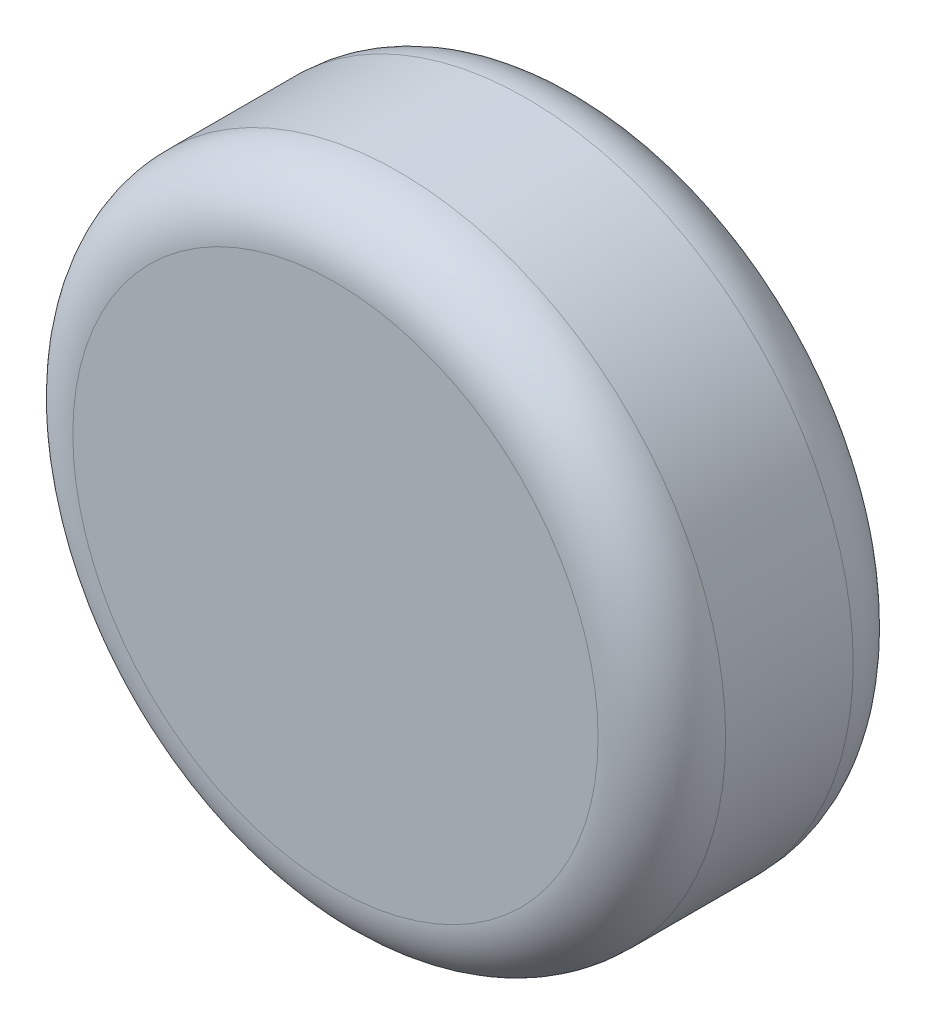
ISO-10303-21;
HEADER;
FILE_DESCRIPTION(('STEP AP214'),'2;1');
FILE_NAME('part.step','',(''),(''),'','','');
FILE_SCHEMA(('AUTOMOTIVE_DESIGN { 1 0 10303 214 1 1 1 1 }'));
ENDSEC;
DATA;
#1=APPLICATION_CONTEXT('core data for automotive mechanical design processes');
#2=APPLICATION_PROTOCOL_DEFINITION('international standard','automotive_design',2000,#1);
#3=PRODUCT_CONTEXT('',#1,'mechanical');
#4=PRODUCT('Part','Part','',(#3));
#5=PRODUCT_RELATED_PRODUCT_CATEGORY('part','',(#4));
#6=PRODUCT_DEFINITION_FORMATION('','',#4);
#7=PRODUCT_DEFINITION_CONTEXT('part definition',#1,'design');
#8=PRODUCT_DEFINITION('design','',#6,#7);
#9=PRODUCT_DEFINITION_SHAPE('','',#8);
#10=(LENGTH_UNIT() NAMED_UNIT(*) SI_UNIT(.MILLI.,.METRE.));
#11=(NAMED_UNIT(*) PLANE_ANGLE_UNIT() SI_UNIT($,.RADIAN.));
#12=(NAMED_UNIT(*) SI_UNIT($,.STERADIAN.) SOLID_ANGLE_UNIT());
#13=UNCERTAINTY_MEASURE_WITH_UNIT(LENGTH_MEASURE(1.E-05),#10,'distance_accuracy_value','');
#14=(GEOMETRIC_REPRESENTATION_CONTEXT(3) GLOBAL_UNCERTAINTY_ASSIGNED_CONTEXT((#13)) GLOBAL_UNIT_ASSIGNED_CONTEXT((#10,
#11,#12)) REPRESENTATION_CONTEXT('',''));
#15=CARTESIAN_POINT('',(0.,0.,0.));
#16=DIRECTION('',(0.,0.,1.));
#17=DIRECTION('',(1.,0.,0.));
#18=AXIS2_PLACEMENT_3D('',#15,#16,#17);
#19=CARTESIAN_POINT('',(0.,0.,25.4));
#20=DIRECTION('',(0.,0.,-1.));
#21=DIRECTION('',(-1.,0.,0.));
#22=AXIS2_PLACEMENT_3D('',#19,#20,#21);
#23=CYLINDRICAL_SURFACE('',#22,32.5);
#24=CARTESIAN_POINT('',(0.,0.,6.35));
#25=DIRECTION('',(0.,0.,1.));
#26=DIRECTION('',(1.,0.,0.));
#27=AXIS2_PLACEMENT_3D('',#24,#25,#26);
#28=CIRCLE('',#27,32.5);
#29=CARTESIAN_POINT('',(32.5,0.,6.35));
#30=VERTEX_POINT('',#29);
#31=EDGE_CURVE('E148',#30,#30,#28,.T.);
#32=ORIENTED_EDGE('',*,*,#31,.T.);
#33=EDGE_LOOP('',(#32));
#34=FACE_BOUND('',#33,.T.);
#35=CARTESIAN_POINT('',(0.,0.,19.05));
#36=DIRECTION('',(0.,0.,1.));
#37=DIRECTION('',(1.,0.,0.));
#38=AXIS2_PLACEMENT_3D('',#35,#36,#37);
#39=CIRCLE('',#38,32.5);
#40=CARTESIAN_POINT('',(32.5,0.,19.05));
#41=VERTEX_POINT('',#40);
#42=EDGE_CURVE('E140',#41,#41,#39,.F.);
#43=ORIENTED_EDGE('',*,*,#42,.T.);
#44=EDGE_LOOP('',(#43));
#45=FACE_BOUND('',#44,.T.);
#46=ADVANCED_FACE('F38',(#34,#45),#23,.T.);
#47=CARTESIAN_POINT('',(0.,0.,25.4));
#48=DIRECTION('',(0.,0.,1.));
#49=DIRECTION('',(1.,0.,0.));
#50=AXIS2_PLACEMENT_3D('',#47,#48,#49);
#51=PLANE('',#50);
#52=CARTESIAN_POINT('',(0.,0.,25.4));
#53=DIRECTION('',(0.,0.,1.));
#54=DIRECTION('',(1.,0.,0.));
#55=AXIS2_PLACEMENT_3D('',#52,#53,#54);
#56=CIRCLE('',#55,26.15);
#57=CARTESIAN_POINT('',(26.15,0.,25.4));
#58=VERTEX_POINT('',#57);
#59=EDGE_CURVE('E11',#58,#58,#56,.T.);
#60=ORIENTED_EDGE('',*,*,#59,.T.);
#61=EDGE_LOOP('',(#60));
#62=FACE_BOUND('',#61,.T.);
#63=ADVANCED_FACE('F162',(#62),#51,.T.);
#64=CARTESIAN_POINT('',(0.,0.,0.));
#65=DIRECTION('',(0.,0.,1.));
#66=DIRECTION('',(1.,0.,0.));
#67=AXIS2_PLACEMENT_3D('',#64,#65,#66);
#68=PLANE('',#67);
#69=DIRECTION('',(-0.5,0.866025403784439,0.));
#70=VECTOR('',#69,1.);
#71=CARTESIAN_POINT('',(-3.46410161513776,-6.,0.));
#72=LINE('',#71,#70);
#73=CARTESIAN_POINT('',(-3.46410161513776,-6.,0.));
#74=VERTEX_POINT('',#73);
#75=CARTESIAN_POINT('',(-6.92820323027551,0.,0.));
#76=VERTEX_POINT('',#75);
#77=EDGE_CURVE('E127',#74,#76,#72,.T.);
#78=ORIENTED_EDGE('',*,*,#77,.F.);
#79=DIRECTION('',(-1.,0.,0.));
#80=VECTOR('',#79,1.);
#81=CARTESIAN_POINT('',(3.46410161513776,-6.,0.));
#82=LINE('',#81,#80);
#83=CARTESIAN_POINT('',(3.46410161513776,-6.,0.));
#84=VERTEX_POINT('',#83);
#85=EDGE_CURVE('E53',#84,#74,#82,.T.);
#86=ORIENTED_EDGE('',*,*,#85,.F.);
#87=DIRECTION('',(-0.5,-0.866025403784439,0.));
#88=VECTOR('',#87,1.);
#89=CARTESIAN_POINT('',(6.92820323027551,0.,0.));
#90=LINE('',#89,#88);
#91=CARTESIAN_POINT('',(6.92820323027551,0.,0.));
#92=VERTEX_POINT('',#91);
#93=EDGE_CURVE('E136',#92,#84,#90,.T.);
#94=ORIENTED_EDGE('',*,*,#93,.F.);
#95=DIRECTION('',(0.5,-0.866025403784439,0.));
#96=VECTOR('',#95,1.);
#97=CARTESIAN_POINT('',(3.46410161513776,6.,0.));
#98=LINE('',#97,#96);
#99=CARTESIAN_POINT('',(3.46410161513776,6.,0.));
#100=VERTEX_POINT('',#99);
#101=EDGE_CURVE('E134',#100,#92,#98,.T.);
#102=ORIENTED_EDGE('',*,*,#101,.F.);
#103=DIRECTION('',(1.,0.,0.));
#104=VECTOR('',#103,1.);
#105=CARTESIAN_POINT('',(-3.46410161513776,6.,0.));
#106=LINE('',#105,#104);
#107=CARTESIAN_POINT('',(-3.46410161513776,6.,0.));
#108=VERTEX_POINT('',#107);
#109=EDGE_CURVE('E101',#108,#100,#106,.T.);
#110=ORIENTED_EDGE('',*,*,#109,.F.);
#111=DIRECTION('',(0.5,0.866025403784439,0.));
#112=VECTOR('',#111,1.);
#113=CARTESIAN_POINT('',(-6.92820323027551,0.,0.));
#114=LINE('',#113,#112);
#115=EDGE_CURVE('E130',#76,#108,#114,.T.);
#116=ORIENTED_EDGE('',*,*,#115,.F.);
#117=EDGE_LOOP('',(#78,#86,#94,#102,#110,#116));
#118=FACE_BOUND('',#117,.T.);
#119=CARTESIAN_POINT('',(0.,0.,0.));
#120=DIRECTION('',(0.,0.,1.));
#121=DIRECTION('',(1.,0.,0.));
#122=AXIS2_PLACEMENT_3D('',#119,#120,#121);
#123=CIRCLE('',#122,26.15);
#124=CARTESIAN_POINT('',(26.15,0.,0.));
#125=VERTEX_POINT('',#124);
#126=EDGE_CURVE('E46',#125,#125,#123,.F.);
#127=ORIENTED_EDGE('',*,*,#126,.T.);
#128=EDGE_LOOP('',(#127));
#129=FACE_BOUND('',#128,.T.);
#130=ADVANCED_FACE('F153',(#118,#129),#68,.F.);
#131=CARTESIAN_POINT('',(0.,0.,6.35));
#132=DIRECTION('',(0.,0.,1.));
#133=DIRECTION('',(1.,0.,0.));
#134=AXIS2_PLACEMENT_3D('',#131,#132,#133);
#135=TOROIDAL_SURFACE('',#134,26.15,6.35);
#136=ORIENTED_EDGE('',*,*,#126,.F.);
#137=EDGE_LOOP('',(#136));
#138=FACE_BOUND('',#137,.T.);
#139=ORIENTED_EDGE('',*,*,#31,.F.);
#140=EDGE_LOOP('',(#139));
#141=FACE_BOUND('',#140,.T.);
#142=ADVANCED_FACE('F155',(#138,#141),#135,.T.);
#143=CARTESIAN_POINT('',(0.,0.,19.05));
#144=DIRECTION('',(0.,0.,1.));
#145=DIRECTION('',(1.,0.,0.));
#146=AXIS2_PLACEMENT_3D('',#143,#144,#145);
#147=TOROIDAL_SURFACE('',#146,26.15,6.35);
#148=ORIENTED_EDGE('',*,*,#42,.F.);
#149=EDGE_LOOP('',(#148));
#150=FACE_BOUND('',#149,.T.);
#151=ORIENTED_EDGE('',*,*,#59,.F.);
#152=EDGE_LOOP('',(#151));
#153=FACE_BOUND('',#152,.T.);
#154=ADVANCED_FACE('F40',(#150,#153),#147,.T.);
#155=CARTESIAN_POINT('',(3.46410161513776,-6.,15.621));
#156=DIRECTION('',(0.,-1.,0.));
#157=DIRECTION('',(0.,0.,-1.));
#158=AXIS2_PLACEMENT_3D('',#155,#156,#157);
#159=PLANE('',#158);
#160=ORIENTED_EDGE('',*,*,#85,.T.);
#161=DIRECTION('',(0.,0.,-1.));
#162=VECTOR('',#161,1.);
#163=CARTESIAN_POINT('',(-3.46410161513776,-6.,15.621));
#164=LINE('',#163,#162);
#165=CARTESIAN_POINT('',(-3.46410161513776,-6.,15.621));
#166=VERTEX_POINT('',#165);
#167=EDGE_CURVE('E83',#166,#74,#164,.T.);
#168=ORIENTED_EDGE('',*,*,#167,.F.);
#169=DIRECTION('',(-1.,0.,0.));
#170=VECTOR('',#169,1.);
#171=CARTESIAN_POINT('',(3.46410161513776,-6.,15.621));
#172=LINE('',#171,#170);
#173=CARTESIAN_POINT('',(3.46410161513776,-6.,15.621));
#174=VERTEX_POINT('',#173);
#175=EDGE_CURVE('E138',#174,#166,#172,.T.);
#176=ORIENTED_EDGE('',*,*,#175,.F.);
#177=DIRECTION('',(0.,0.,-1.));
#178=VECTOR('',#177,1.);
#179=CARTESIAN_POINT('',(3.46410161513776,-6.,15.621));
#180=LINE('',#179,#178);
#181=EDGE_CURVE('E61',#174,#84,#180,.T.);
#182=ORIENTED_EDGE('',*,*,#181,.T.);
#183=EDGE_LOOP('',(#160,#168,#176,#182));
#184=FACE_BOUND('',#183,.T.);
#185=ADVANCED_FACE('F168',(#184),#159,.F.);
#186=CARTESIAN_POINT('',(6.92820323027551,0.,15.621));
#187=DIRECTION('',(0.866025403784439,-0.5,0.));
#188=DIRECTION('',(0.5,0.866025403784439,0.));
#189=AXIS2_PLACEMENT_3D('',#186,#187,#188);
#190=PLANE('',#189);
#191=ORIENTED_EDGE('',*,*,#93,.T.);
#192=ORIENTED_EDGE('',*,*,#181,.F.);
#193=DIRECTION('',(-0.5,-0.866025403784439,0.));
#194=VECTOR('',#193,1.);
#195=CARTESIAN_POINT('',(6.92820323027551,0.,15.621));
#196=LINE('',#195,#194);
#197=CARTESIAN_POINT('',(6.92820323027551,0.,15.621));
#198=VERTEX_POINT('',#197);
#199=EDGE_CURVE('E113',#198,#174,#196,.T.);
#200=ORIENTED_EDGE('',*,*,#199,.F.);
#201=DIRECTION('',(0.,0.,-1.));
#202=VECTOR('',#201,1.);
#203=CARTESIAN_POINT('',(6.92820323027551,0.,15.621));
#204=LINE('',#203,#202);
#205=EDGE_CURVE('E105',#198,#92,#204,.T.);
#206=ORIENTED_EDGE('',*,*,#205,.T.);
#207=EDGE_LOOP('',(#191,#192,#200,#206));
#208=FACE_BOUND('',#207,.T.);
#209=ADVANCED_FACE('F181',(#208),#190,.F.);
#210=CARTESIAN_POINT('',(3.46410161513776,6.,15.621));
#211=DIRECTION('',(0.866025403784439,0.5,0.));
#212=DIRECTION('',(-0.5,0.866025403784439,0.));
#213=AXIS2_PLACEMENT_3D('',#210,#211,#212);
#214=PLANE('',#213);
#215=ORIENTED_EDGE('',*,*,#101,.T.);
#216=ORIENTED_EDGE('',*,*,#205,.F.);
#217=DIRECTION('',(0.5,-0.866025403784439,0.));
#218=VECTOR('',#217,1.);
#219=CARTESIAN_POINT('',(3.46410161513776,6.,15.621));
#220=LINE('',#219,#218);
#221=CARTESIAN_POINT('',(3.46410161513776,6.,15.621));
#222=VERTEX_POINT('',#221);
#223=EDGE_CURVE('E109',#222,#198,#220,.T.);
#224=ORIENTED_EDGE('',*,*,#223,.F.);
#225=DIRECTION('',(0.,0.,-1.));
#226=VECTOR('',#225,1.);
#227=CARTESIAN_POINT('',(3.46410161513776,6.,15.621));
#228=LINE('',#227,#226);
#229=EDGE_CURVE('E94',#222,#100,#228,.T.);
#230=ORIENTED_EDGE('',*,*,#229,.T.);
#231=EDGE_LOOP('',(#215,#216,#224,#230));
#232=FACE_BOUND('',#231,.T.);
#233=ADVANCED_FACE('F110',(#232),#214,.F.);
#234=CARTESIAN_POINT('',(-3.46410161513776,6.,15.621));
#235=DIRECTION('',(0.,1.,0.));
#236=DIRECTION('',(0.,0.,1.));
#237=AXIS2_PLACEMENT_3D('',#234,#235,#236);
#238=PLANE('',#237);
#239=ORIENTED_EDGE('',*,*,#109,.T.);
#240=ORIENTED_EDGE('',*,*,#229,.F.);
#241=DIRECTION('',(1.,0.,0.));
#242=VECTOR('',#241,1.);
#243=CARTESIAN_POINT('',(-3.46410161513776,6.,15.621));
#244=LINE('',#243,#242);
#245=CARTESIAN_POINT('',(-3.46410161513776,6.,15.621));
#246=VERTEX_POINT('',#245);
#247=EDGE_CURVE('E98',#246,#222,#244,.T.);
#248=ORIENTED_EDGE('',*,*,#247,.F.);
#249=DIRECTION('',(0.,0.,-1.));
#250=VECTOR('',#249,1.);
#251=CARTESIAN_POINT('',(-3.46410161513776,6.,15.621));
#252=LINE('',#251,#250);
#253=EDGE_CURVE('E106',#246,#108,#252,.T.);
#254=ORIENTED_EDGE('',*,*,#253,.T.);
#255=EDGE_LOOP('',(#239,#240,#248,#254));
#256=FACE_BOUND('',#255,.T.);
#257=ADVANCED_FACE('F96',(#256),#238,.F.);
#258=CARTESIAN_POINT('',(-6.92820323027551,0.,15.621));
#259=DIRECTION('',(-0.866025403784439,0.5,0.));
#260=DIRECTION('',(-0.5,-0.866025403784439,0.));
#261=AXIS2_PLACEMENT_3D('',#258,#259,#260);
#262=PLANE('',#261);
#263=ORIENTED_EDGE('',*,*,#115,.T.);
#264=ORIENTED_EDGE('',*,*,#253,.F.);
#265=DIRECTION('',(0.5,0.866025403784439,0.));
#266=VECTOR('',#265,1.);
#267=CARTESIAN_POINT('',(-6.92820323027551,0.,15.621));
#268=LINE('',#267,#266);
#269=CARTESIAN_POINT('',(-6.92820323027551,0.,15.621));
#270=VERTEX_POINT('',#269);
#271=EDGE_CURVE('E119',#270,#246,#268,.T.);
#272=ORIENTED_EDGE('',*,*,#271,.F.);
#273=DIRECTION('',(0.,0.,-1.));
#274=VECTOR('',#273,1.);
#275=CARTESIAN_POINT('',(-6.92820323027551,0.,15.621));
#276=LINE('',#275,#274);
#277=EDGE_CURVE('E143',#270,#76,#276,.T.);
#278=ORIENTED_EDGE('',*,*,#277,.T.);
#279=EDGE_LOOP('',(#263,#264,#272,#278));
#280=FACE_BOUND('',#279,.T.);
#281=ADVANCED_FACE('F185',(#280),#262,.F.);
#282=CARTESIAN_POINT('',(-3.46410161513776,-6.,15.621));
#283=DIRECTION('',(-0.866025403784438,-0.5,0.));
#284=DIRECTION('',(0.5,-0.866025403784439,0.));
#285=AXIS2_PLACEMENT_3D('',#282,#283,#284);
#286=PLANE('',#285);
#287=ORIENTED_EDGE('',*,*,#77,.T.);
#288=ORIENTED_EDGE('',*,*,#277,.F.);
#289=DIRECTION('',(-0.5,0.866025403784439,0.));
#290=VECTOR('',#289,1.);
#291=CARTESIAN_POINT('',(-3.46410161513776,-6.,15.621));
#292=LINE('',#291,#290);
#293=EDGE_CURVE('E121',#166,#270,#292,.T.);
#294=ORIENTED_EDGE('',*,*,#293,.F.);
#295=ORIENTED_EDGE('',*,*,#167,.T.);
#296=EDGE_LOOP('',(#287,#288,#294,#295));
#297=FACE_BOUND('',#296,.T.);
#298=ADVANCED_FACE('F182',(#297),#286,.F.);
#299=CARTESIAN_POINT('',(0.,0.,15.621));
#300=DIRECTION('',(0.,0.,-1.));
#301=DIRECTION('',(-1.,0.,0.));
#302=AXIS2_PLACEMENT_3D('',#299,#300,#301);
#303=PLANE('',#302);
#304=ORIENTED_EDGE('',*,*,#175,.T.);
#305=ORIENTED_EDGE('',*,*,#293,.T.);
#306=ORIENTED_EDGE('',*,*,#271,.T.);
#307=ORIENTED_EDGE('',*,*,#247,.T.);
#308=ORIENTED_EDGE('',*,*,#223,.T.);
#309=ORIENTED_EDGE('',*,*,#199,.T.);
#310=EDGE_LOOP('',(#304,#305,#306,#307,#308,#309));
#311=FACE_BOUND('',#310,.T.);
#312=ADVANCED_FACE('F116',(#311),#303,.T.);
#313=CLOSED_SHELL('',(#46,#63,#130,#142,#154,#185,#209,#233,#257,#281,#298,#312));
#314=MANIFOLD_SOLID_BREP('B2',#313);
#315=ADVANCED_BREP_SHAPE_REPRESENTATION('',(#18,#314),#14);
#316=SHAPE_DEFINITION_REPRESENTATION(#9,#315);
ENDSEC;
END-ISO-10303-21;
